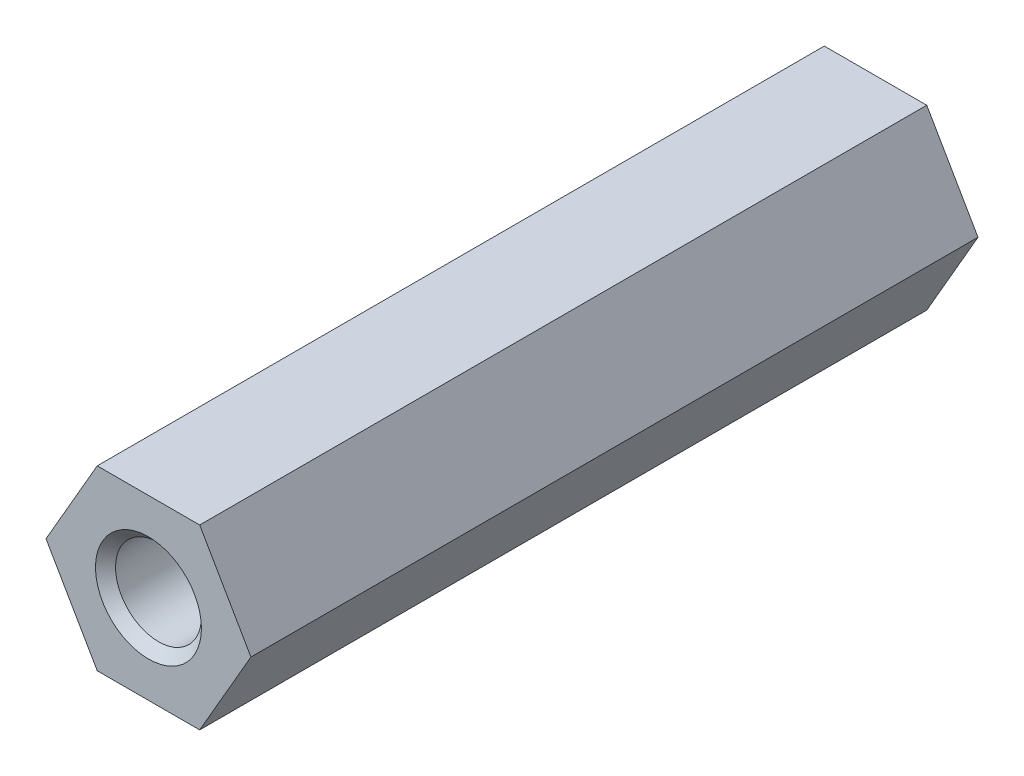
ISO-10303-21;
HEADER;
FILE_DESCRIPTION(('STEP AP214'),'2;1');
FILE_NAME('part.step','',(''),(''),'','','');
FILE_SCHEMA(('AUTOMOTIVE_DESIGN { 1 0 10303 214 1 1 1 1 }'));
ENDSEC;
DATA;
#1=APPLICATION_CONTEXT('core data for automotive mechanical design processes');
#2=APPLICATION_PROTOCOL_DEFINITION('international standard','automotive_design',2000,#1);
#3=PRODUCT_CONTEXT('',#1,'mechanical');
#4=PRODUCT('Part','Part','',(#3));
#5=PRODUCT_RELATED_PRODUCT_CATEGORY('part','',(#4));
#6=PRODUCT_DEFINITION_FORMATION('','',#4);
#7=PRODUCT_DEFINITION_CONTEXT('part definition',#1,'design');
#8=PRODUCT_DEFINITION('design','',#6,#7);
#9=PRODUCT_DEFINITION_SHAPE('','',#8);
#10=(LENGTH_UNIT() NAMED_UNIT(*) SI_UNIT(.MILLI.,.METRE.));
#11=(NAMED_UNIT(*) PLANE_ANGLE_UNIT() SI_UNIT($,.RADIAN.));
#12=(NAMED_UNIT(*) SI_UNIT($,.STERADIAN.) SOLID_ANGLE_UNIT());
#13=UNCERTAINTY_MEASURE_WITH_UNIT(LENGTH_MEASURE(1.E-05),#10,'distance_accuracy_value','');
#14=(GEOMETRIC_REPRESENTATION_CONTEXT(3) GLOBAL_UNCERTAINTY_ASSIGNED_CONTEXT((#13)) GLOBAL_UNIT_ASSIGNED_CONTEXT((#10,
#11,#12)) REPRESENTATION_CONTEXT('',''));
#15=CARTESIAN_POINT('',(0.,0.,0.));
#16=DIRECTION('',(0.,0.,1.));
#17=DIRECTION('',(1.,0.,0.));
#18=AXIS2_PLACEMENT_3D('',#15,#16,#17);
#19=CARTESIAN_POINT('',(1.78978583448784,-3.1,0.));
#20=DIRECTION('',(0.866025403784439,-0.5,0.));
#21=DIRECTION('',(0.5,0.866025403784439,0.));
#22=AXIS2_PLACEMENT_3D('',#19,#20,#21);
#23=PLANE('',#22);
#24=DIRECTION('',(0.5,0.866025403784439,0.));
#25=VECTOR('',#24,1.);
#26=CARTESIAN_POINT('',(1.78978583448784,-3.1,25.4));
#27=LINE('',#26,#25);
#28=CARTESIAN_POINT('',(1.78978583448784,-3.1,25.4));
#29=VERTEX_POINT('',#28);
#30=CARTESIAN_POINT('',(3.57957166897568,0.,25.4));
#31=VERTEX_POINT('',#30);
#32=EDGE_CURVE('E83',#29,#31,#27,.T.);
#33=ORIENTED_EDGE('',*,*,#32,.F.);
#34=DIRECTION('',(0.,0.,-1.));
#35=VECTOR('',#34,1.);
#36=CARTESIAN_POINT('',(1.78978583448784,-3.1,0.));
#37=LINE('',#36,#35);
#38=CARTESIAN_POINT('',(1.78978583448784,-3.1,0.));
#39=VERTEX_POINT('',#38);
#40=EDGE_CURVE('E71',#39,#29,#37,.F.);
#41=ORIENTED_EDGE('',*,*,#40,.F.);
#42=DIRECTION('',(0.5,0.866025403784439,0.));
#43=VECTOR('',#42,1.);
#44=CARTESIAN_POINT('',(1.78978583448784,-3.1,0.));
#45=LINE('',#44,#43);
#46=CARTESIAN_POINT('',(3.57957166897568,0.,0.));
#47=VERTEX_POINT('',#46);
#48=EDGE_CURVE('E125',#39,#47,#45,.T.);
#49=ORIENTED_EDGE('',*,*,#48,.T.);
#50=DIRECTION('',(0.,0.,1.));
#51=VECTOR('',#50,1.);
#52=CARTESIAN_POINT('',(3.57957166897568,0.,0.));
#53=LINE('',#52,#51);
#54=EDGE_CURVE('E87',#31,#47,#53,.F.);
#55=ORIENTED_EDGE('',*,*,#54,.F.);
#56=EDGE_LOOP('',(#33,#41,#49,#55));
#57=FACE_BOUND('',#56,.T.);
#58=ADVANCED_FACE('F18',(#57),#23,.T.);
#59=CARTESIAN_POINT('',(3.57957166897568,0.,0.));
#60=DIRECTION('',(0.866025403784438,0.5,0.));
#61=DIRECTION('',(-0.5,0.866025403784438,0.));
#62=AXIS2_PLACEMENT_3D('',#59,#60,#61);
#63=PLANE('',#62);
#64=DIRECTION('',(-0.5,0.866025403784439,0.));
#65=VECTOR('',#64,1.);
#66=CARTESIAN_POINT('',(3.57957166897568,0.,25.4));
#67=LINE('',#66,#65);
#68=CARTESIAN_POINT('',(1.78978583448784,3.1,25.4));
#69=VERTEX_POINT('',#68);
#70=EDGE_CURVE('E89',#31,#69,#67,.T.);
#71=ORIENTED_EDGE('',*,*,#70,.F.);
#72=ORIENTED_EDGE('',*,*,#54,.T.);
#73=DIRECTION('',(-0.5,0.866025403784439,0.));
#74=VECTOR('',#73,1.);
#75=CARTESIAN_POINT('',(3.57957166897568,0.,0.));
#76=LINE('',#75,#74);
#77=CARTESIAN_POINT('',(1.78978583448784,3.1,0.));
#78=VERTEX_POINT('',#77);
#79=EDGE_CURVE('E122',#47,#78,#76,.T.);
#80=ORIENTED_EDGE('',*,*,#79,.T.);
#81=DIRECTION('',(0.,0.,1.));
#82=VECTOR('',#81,1.);
#83=CARTESIAN_POINT('',(1.78978583448784,3.1,0.));
#84=LINE('',#83,#82);
#85=EDGE_CURVE('E99',#69,#78,#84,.F.);
#86=ORIENTED_EDGE('',*,*,#85,.F.);
#87=EDGE_LOOP('',(#71,#72,#80,#86));
#88=FACE_BOUND('',#87,.T.);
#89=ADVANCED_FACE('F228',(#88),#63,.T.);
#90=CARTESIAN_POINT('',(1.78978583448784,3.1,0.));
#91=DIRECTION('',(0.,1.,0.));
#92=DIRECTION('',(0.,0.,1.));
#93=AXIS2_PLACEMENT_3D('',#90,#91,#92);
#94=PLANE('',#93);
#95=DIRECTION('',(1.,0.,0.));
#96=VECTOR('',#95,1.);
#97=CARTESIAN_POINT('',(0.,3.1,25.4));
#98=LINE('',#97,#96);
#99=CARTESIAN_POINT('',(-1.78978583448784,3.1,25.4));
#100=VERTEX_POINT('',#99);
#101=EDGE_CURVE('E91',#69,#100,#98,.F.);
#102=ORIENTED_EDGE('',*,*,#101,.F.);
#103=ORIENTED_EDGE('',*,*,#85,.T.);
#104=DIRECTION('',(1.,0.,0.));
#105=VECTOR('',#104,1.);
#106=CARTESIAN_POINT('',(0.,3.1,0.));
#107=LINE('',#106,#105);
#108=CARTESIAN_POINT('',(-1.78978583448784,3.1,0.));
#109=VERTEX_POINT('',#108);
#110=EDGE_CURVE('E119',#78,#109,#107,.F.);
#111=ORIENTED_EDGE('',*,*,#110,.T.);
#112=DIRECTION('',(0.,0.,1.));
#113=VECTOR('',#112,1.);
#114=CARTESIAN_POINT('',(-1.78978583448784,3.1,0.));
#115=LINE('',#114,#113);
#116=EDGE_CURVE('E97',#100,#109,#115,.F.);
#117=ORIENTED_EDGE('',*,*,#116,.F.);
#118=EDGE_LOOP('',(#102,#103,#111,#117));
#119=FACE_BOUND('',#118,.T.);
#120=ADVANCED_FACE('F135',(#119),#94,.T.);
#121=CARTESIAN_POINT('',(-1.78978583448784,3.1,0.));
#122=DIRECTION('',(-0.866025403784439,0.5,0.));
#123=DIRECTION('',(-0.5,-0.866025403784439,0.));
#124=AXIS2_PLACEMENT_3D('',#121,#122,#123);
#125=PLANE('',#124);
#126=DIRECTION('',(-0.5,-0.866025403784439,0.));
#127=VECTOR('',#126,1.);
#128=CARTESIAN_POINT('',(-1.78978583448784,3.1,25.4));
#129=LINE('',#128,#127);
#130=CARTESIAN_POINT('',(-3.57957166897568,0.,25.4));
#131=VERTEX_POINT('',#130);
#132=EDGE_CURVE('E128',#100,#131,#129,.T.);
#133=ORIENTED_EDGE('',*,*,#132,.F.);
#134=ORIENTED_EDGE('',*,*,#116,.T.);
#135=DIRECTION('',(-0.5,-0.866025403784439,0.));
#136=VECTOR('',#135,1.);
#137=CARTESIAN_POINT('',(-1.78978583448784,3.1,0.));
#138=LINE('',#137,#136);
#139=CARTESIAN_POINT('',(-3.57957166897568,0.,0.));
#140=VERTEX_POINT('',#139);
#141=EDGE_CURVE('E112',#109,#140,#138,.T.);
#142=ORIENTED_EDGE('',*,*,#141,.T.);
#143=DIRECTION('',(0.,0.,1.));
#144=VECTOR('',#143,1.);
#145=CARTESIAN_POINT('',(-3.57957166897568,0.,0.));
#146=LINE('',#145,#144);
#147=EDGE_CURVE('E79',#131,#140,#146,.F.);
#148=ORIENTED_EDGE('',*,*,#147,.F.);
#149=EDGE_LOOP('',(#133,#134,#142,#148));
#150=FACE_BOUND('',#149,.T.);
#151=ADVANCED_FACE('F139',(#150),#125,.T.);
#152=CARTESIAN_POINT('',(-3.57957166897568,0.,0.));
#153=DIRECTION('',(-0.866025403784439,-0.5,0.));
#154=DIRECTION('',(0.5,-0.866025403784439,0.));
#155=AXIS2_PLACEMENT_3D('',#152,#153,#154);
#156=PLANE('',#155);
#157=DIRECTION('',(0.5,-0.866025403784439,0.));
#158=VECTOR('',#157,1.);
#159=CARTESIAN_POINT('',(-3.57957166897568,0.,25.4));
#160=LINE('',#159,#158);
#161=CARTESIAN_POINT('',(-1.78978583448784,-3.1,25.4));
#162=VERTEX_POINT('',#161);
#163=EDGE_CURVE('E85',#131,#162,#160,.T.);
#164=ORIENTED_EDGE('',*,*,#163,.F.);
#165=ORIENTED_EDGE('',*,*,#147,.T.);
#166=DIRECTION('',(0.5,-0.866025403784439,0.));
#167=VECTOR('',#166,1.);
#168=CARTESIAN_POINT('',(-3.57957166897568,0.,0.));
#169=LINE('',#168,#167);
#170=CARTESIAN_POINT('',(-1.78978583448784,-3.1,0.));
#171=VERTEX_POINT('',#170);
#172=EDGE_CURVE('E110',#140,#171,#169,.T.);
#173=ORIENTED_EDGE('',*,*,#172,.T.);
#174=DIRECTION('',(0.,0.,-1.));
#175=VECTOR('',#174,1.);
#176=CARTESIAN_POINT('',(-1.78978583448784,-3.1,0.));
#177=LINE('',#176,#175);
#178=EDGE_CURVE('E36',#162,#171,#177,.T.);
#179=ORIENTED_EDGE('',*,*,#178,.F.);
#180=EDGE_LOOP('',(#164,#165,#173,#179));
#181=FACE_BOUND('',#180,.T.);
#182=ADVANCED_FACE('F141',(#181),#156,.T.);
#183=CARTESIAN_POINT('',(-1.78978583448784,-3.1,0.));
#184=DIRECTION('',(0.,-1.,0.));
#185=DIRECTION('',(0.,0.,-1.));
#186=AXIS2_PLACEMENT_3D('',#183,#184,#185);
#187=PLANE('',#186);
#188=DIRECTION('',(1.,0.,0.));
#189=VECTOR('',#188,1.);
#190=CARTESIAN_POINT('',(0.,-3.1,25.4));
#191=LINE('',#190,#189);
#192=EDGE_CURVE('E74',#162,#29,#191,.T.);
#193=ORIENTED_EDGE('',*,*,#192,.F.);
#194=ORIENTED_EDGE('',*,*,#178,.T.);
#195=DIRECTION('',(1.,0.,0.));
#196=VECTOR('',#195,1.);
#197=CARTESIAN_POINT('',(0.,-3.1,0.));
#198=LINE('',#197,#196);
#199=EDGE_CURVE('E75',#171,#39,#198,.T.);
#200=ORIENTED_EDGE('',*,*,#199,.T.);
#201=ORIENTED_EDGE('',*,*,#40,.T.);
#202=EDGE_LOOP('',(#193,#194,#200,#201));
#203=FACE_BOUND('',#202,.T.);
#204=ADVANCED_FACE('F73',(#203),#187,.T.);
#205=CARTESIAN_POINT('',(0.,0.,25.4));
#206=DIRECTION('',(0.,0.,1.));
#207=DIRECTION('',(1.,0.,0.));
#208=AXIS2_PLACEMENT_3D('',#205,#206,#207);
#209=PLANE('',#208);
#210=CARTESIAN_POINT('',(0.,0.,25.3999999999905));
#211=DIRECTION('',(0.,0.,1.));
#212=DIRECTION('',(1.,0.,0.));
#213=AXIS2_PLACEMENT_3D('',#210,#211,#212);
#214=CIRCLE('',#213,1.8500000000472);
#215=CARTESIAN_POINT('',(1.8500000000472,0.,25.3999999999905));
#216=VERTEX_POINT('',#215);
#217=EDGE_CURVE('E21',#216,#216,#214,.F.);
#218=ORIENTED_EDGE('',*,*,#217,.T.);
#219=EDGE_LOOP('',(#218));
#220=FACE_BOUND('',#219,.T.);
#221=ORIENTED_EDGE('',*,*,#132,.T.);
#222=ORIENTED_EDGE('',*,*,#163,.T.);
#223=ORIENTED_EDGE('',*,*,#192,.T.);
#224=ORIENTED_EDGE('',*,*,#32,.T.);
#225=ORIENTED_EDGE('',*,*,#70,.T.);
#226=ORIENTED_EDGE('',*,*,#101,.T.);
#227=EDGE_LOOP('',(#221,#222,#223,#224,#225,#226));
#228=FACE_BOUND('',#227,.T.);
#229=ADVANCED_FACE('F82',(#220,#228),#209,.T.);
#230=CARTESIAN_POINT('',(0.,0.,0.));
#231=DIRECTION('',(0.,0.,1.));
#232=DIRECTION('',(1.,0.,0.));
#233=AXIS2_PLACEMENT_3D('',#230,#231,#232);
#234=PLANE('',#233);
#235=CARTESIAN_POINT('',(0.,0.,0.));
#236=DIRECTION('',(0.,0.,-1.));
#237=DIRECTION('',(-1.,0.,0.));
#238=AXIS2_PLACEMENT_3D('',#235,#236,#237);
#239=CIRCLE('',#238,1.84999999999036);
#240=CARTESIAN_POINT('',(-1.84999999999036,0.,0.));
#241=VERTEX_POINT('',#240);
#242=EDGE_CURVE('E101',#241,#241,#239,.F.);
#243=ORIENTED_EDGE('',*,*,#242,.T.);
#244=EDGE_LOOP('',(#243));
#245=FACE_BOUND('',#244,.T.);
#246=ORIENTED_EDGE('',*,*,#172,.F.);
#247=ORIENTED_EDGE('',*,*,#141,.F.);
#248=ORIENTED_EDGE('',*,*,#110,.F.);
#249=ORIENTED_EDGE('',*,*,#79,.F.);
#250=ORIENTED_EDGE('',*,*,#48,.F.);
#251=ORIENTED_EDGE('',*,*,#199,.F.);
#252=EDGE_LOOP('',(#246,#247,#248,#249,#250,#251));
#253=FACE_BOUND('',#252,.T.);
#254=ADVANCED_FACE('F167',(#245,#253),#234,.F.);
#255=CARTESIAN_POINT('',(0.,0.,25.3999999999905));
#256=DIRECTION('',(0.,0.,1.));
#257=DIRECTION('',(1.,0.,0.));
#258=AXIS2_PLACEMENT_3D('',#255,#256,#257);
#259=CONICAL_SURFACE('',#258,1.8500000000472,0.785398163397448);
#260=CARTESIAN_POINT('',(0.,0.,25.05));
#261=DIRECTION('',(0.,0.,-1.));
#262=DIRECTION('',(-1.,0.,0.));
#263=AXIS2_PLACEMENT_3D('',#260,#261,#262);
#264=CIRCLE('',#263,1.5);
#265=CARTESIAN_POINT('',(-1.5,0.,25.05));
#266=VERTEX_POINT('',#265);
#267=EDGE_CURVE('E27',#266,#266,#264,.T.);
#268=ORIENTED_EDGE('',*,*,#267,.T.);
#269=EDGE_LOOP('',(#268));
#270=FACE_BOUND('',#269,.T.);
#271=ORIENTED_EDGE('',*,*,#217,.F.);
#272=EDGE_LOOP('',(#271));
#273=FACE_BOUND('',#272,.T.);
#274=ADVANCED_FACE('F159',(#270,#273),#259,.F.);
#275=CARTESIAN_POINT('',(0.,0.,5.6843418860808E-11));
#276=DIRECTION('',(0.,0.,-1.));
#277=DIRECTION('',(-1.,0.,0.));
#278=AXIS2_PLACEMENT_3D('',#275,#276,#277);
#279=CONICAL_SURFACE('',#278,1.84999999993352,0.785398163397448);
#280=CARTESIAN_POINT('',(0.,0.,0.35));
#281=DIRECTION('',(0.,0.,-1.));
#282=DIRECTION('',(-1.,0.,0.));
#283=AXIS2_PLACEMENT_3D('',#280,#281,#282);
#284=CIRCLE('',#283,1.5);
#285=CARTESIAN_POINT('',(-1.5,0.,0.35));
#286=VERTEX_POINT('',#285);
#287=EDGE_CURVE('E11',#286,#286,#284,.F.);
#288=ORIENTED_EDGE('',*,*,#287,.T.);
#289=EDGE_LOOP('',(#288));
#290=FACE_BOUND('',#289,.T.);
#291=ORIENTED_EDGE('',*,*,#242,.F.);
#292=EDGE_LOOP('',(#291));
#293=FACE_BOUND('',#292,.T.);
#294=ADVANCED_FACE('F153',(#290,#293),#279,.F.);
#295=CARTESIAN_POINT('',(0.,0.,25.4));
#296=DIRECTION('',(0.,0.,-1.));
#297=DIRECTION('',(-1.,0.,0.));
#298=AXIS2_PLACEMENT_3D('',#295,#296,#297);
#299=CYLINDRICAL_SURFACE('',#298,1.5);
#300=ORIENTED_EDGE('',*,*,#287,.F.);
#301=EDGE_LOOP('',(#300));
#302=FACE_BOUND('',#301,.T.);
#303=ORIENTED_EDGE('',*,*,#267,.F.);
#304=EDGE_LOOP('',(#303));
#305=FACE_BOUND('',#304,.T.);
#306=ADVANCED_FACE('F151',(#302,#305),#299,.F.);
#307=CLOSED_SHELL('',(#58,#89,#120,#151,#182,#204,#229,#254,#274,#294,#306));
#308=MANIFOLD_SOLID_BREP('B1',#307);
#309=ADVANCED_BREP_SHAPE_REPRESENTATION('',(#18,#308),#14);
#310=SHAPE_DEFINITION_REPRESENTATION(#9,#309);
ENDSEC;
END-ISO-10303-21;
